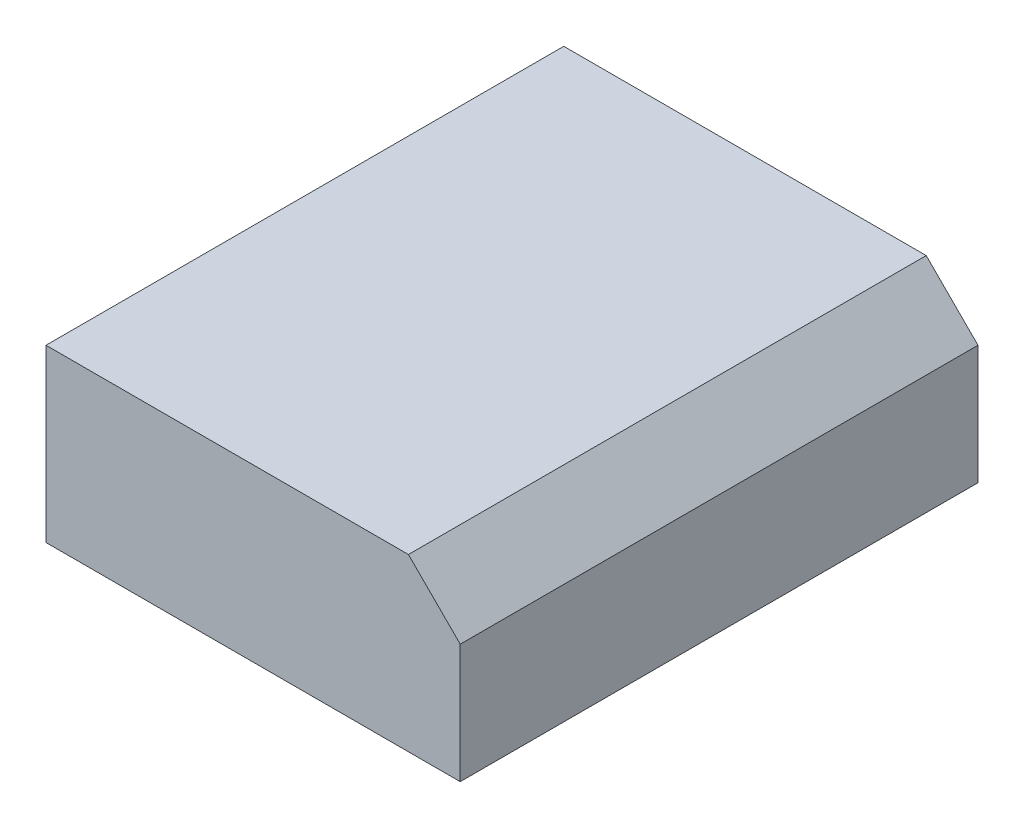
ISO-10303-21;
HEADER;
FILE_DESCRIPTION(('STEP AP214'),'2;1');
FILE_NAME('part.step','',(''),(''),'','','');
FILE_SCHEMA(('AUTOMOTIVE_DESIGN { 1 0 10303 214 1 1 1 1 }'));
ENDSEC;
DATA;
#1=APPLICATION_CONTEXT('core data for automotive mechanical design processes');
#2=APPLICATION_PROTOCOL_DEFINITION('international standard','automotive_design',2000,#1);
#3=PRODUCT_CONTEXT('',#1,'mechanical');
#4=PRODUCT('Part','Part','',(#3));
#5=PRODUCT_RELATED_PRODUCT_CATEGORY('part','',(#4));
#6=PRODUCT_DEFINITION_FORMATION('','',#4);
#7=PRODUCT_DEFINITION_CONTEXT('part definition',#1,'design');
#8=PRODUCT_DEFINITION('design','',#6,#7);
#9=PRODUCT_DEFINITION_SHAPE('','',#8);
#10=(LENGTH_UNIT() NAMED_UNIT(*) SI_UNIT(.MILLI.,.METRE.));
#11=(NAMED_UNIT(*) PLANE_ANGLE_UNIT() SI_UNIT($,.RADIAN.));
#12=(NAMED_UNIT(*) SI_UNIT($,.STERADIAN.) SOLID_ANGLE_UNIT());
#13=UNCERTAINTY_MEASURE_WITH_UNIT(LENGTH_MEASURE(1.E-05),#10,'distance_accuracy_value','');
#14=(GEOMETRIC_REPRESENTATION_CONTEXT(3) GLOBAL_UNCERTAINTY_ASSIGNED_CONTEXT((#13)) GLOBAL_UNIT_ASSIGNED_CONTEXT((#10,
#11,#12)) REPRESENTATION_CONTEXT('',''));
#15=CARTESIAN_POINT('',(0.,0.,0.));
#16=DIRECTION('',(0.,0.,1.));
#17=DIRECTION('',(1.,0.,0.));
#18=AXIS2_PLACEMENT_3D('',#15,#16,#17);
#19=CARTESIAN_POINT('',(1.205,0.1,1.55));
#20=DIRECTION('',(-1.,0.,0.));
#21=DIRECTION('',(0.,0.,1.));
#22=AXIS2_PLACEMENT_3D('',#19,#20,#21);
#23=PLANE('',#22);
#24=DIRECTION('',(0.,0.,-1.));
#25=VECTOR('',#24,1.);
#26=CARTESIAN_POINT('',(1.205,0.,1.55));
#27=LINE('',#26,#25);
#28=CARTESIAN_POINT('',(1.205,0.,1.55));
#29=VERTEX_POINT('',#28);
#30=CARTESIAN_POINT('',(1.205,0.,-1.55));
#31=VERTEX_POINT('',#30);
#32=EDGE_CURVE('E103',#29,#31,#27,.T.);
#33=ORIENTED_EDGE('',*,*,#32,.T.);
#34=DIRECTION('',(0.,-1.,0.));
#35=VECTOR('',#34,1.);
#36=CARTESIAN_POINT('',(1.205,0.1,-1.55));
#37=LINE('',#36,#35);
#38=CARTESIAN_POINT('',(1.205,0.1,-1.55));
#39=VERTEX_POINT('',#38);
#40=EDGE_CURVE('E12',#39,#31,#37,.T.);
#41=ORIENTED_EDGE('',*,*,#40,.F.);
#42=DIRECTION('',(0.,0.,-1.));
#43=VECTOR('',#42,1.);
#44=CARTESIAN_POINT('',(1.205,0.1,1.55));
#45=LINE('',#44,#43);
#46=CARTESIAN_POINT('',(1.205,0.1,1.55));
#47=VERTEX_POINT('',#46);
#48=EDGE_CURVE('E91',#47,#39,#45,.T.);
#49=ORIENTED_EDGE('',*,*,#48,.F.);
#50=DIRECTION('',(0.,-1.,0.));
#51=VECTOR('',#50,1.);
#52=CARTESIAN_POINT('',(1.205,0.1,1.55));
#53=LINE('',#52,#51);
#54=EDGE_CURVE('E99',#47,#29,#53,.T.);
#55=ORIENTED_EDGE('',*,*,#54,.T.);
#56=EDGE_LOOP('',(#33,#41,#49,#55));
#57=FACE_BOUND('',#56,.T.);
#58=ADVANCED_FACE('F40',(#57),#23,.F.);
#59=CARTESIAN_POINT('',(-1.205,0.1,-1.55));
#60=DIRECTION('',(0.,0.,1.));
#61=DIRECTION('',(1.,0.,0.));
#62=AXIS2_PLACEMENT_3D('',#59,#60,#61);
#63=PLANE('',#62);
#64=DIRECTION('',(-1.,0.,0.));
#65=VECTOR('',#64,1.);
#66=CARTESIAN_POINT('',(-1.205,0.,-1.55));
#67=LINE('',#66,#65);
#68=CARTESIAN_POINT('',(-1.205,0.,-1.55));
#69=VERTEX_POINT('',#68);
#70=EDGE_CURVE('E95',#31,#69,#67,.T.);
#71=ORIENTED_EDGE('',*,*,#70,.T.);
#72=DIRECTION('',(0.,-1.,0.));
#73=VECTOR('',#72,1.);
#74=CARTESIAN_POINT('',(-1.205,0.1,-1.55));
#75=LINE('',#74,#73);
#76=CARTESIAN_POINT('',(-1.205,0.1,-1.55));
#77=VERTEX_POINT('',#76);
#78=EDGE_CURVE('E48',#77,#69,#75,.T.);
#79=ORIENTED_EDGE('',*,*,#78,.F.);
#80=DIRECTION('',(-1.,0.,0.));
#81=VECTOR('',#80,1.);
#82=CARTESIAN_POINT('',(-1.205,0.1,-1.55));
#83=LINE('',#82,#81);
#84=EDGE_CURVE('E86',#39,#77,#83,.T.);
#85=ORIENTED_EDGE('',*,*,#84,.F.);
#86=ORIENTED_EDGE('',*,*,#40,.T.);
#87=EDGE_LOOP('',(#71,#79,#85,#86));
#88=FACE_BOUND('',#87,.T.);
#89=ADVANCED_FACE('F94',(#88),#63,.F.);
#90=CARTESIAN_POINT('',(-1.205,0.1,1.55));
#91=DIRECTION('',(1.,0.,0.));
#92=DIRECTION('',(0.,0.,-1.));
#93=AXIS2_PLACEMENT_3D('',#90,#91,#92);
#94=PLANE('',#93);
#95=DIRECTION('',(0.,0.,1.));
#96=VECTOR('',#95,1.);
#97=CARTESIAN_POINT('',(-1.205,0.,1.55));
#98=LINE('',#97,#96);
#99=CARTESIAN_POINT('',(-1.205,0.,1.55));
#100=VERTEX_POINT('',#99);
#101=EDGE_CURVE('E73',#69,#100,#98,.T.);
#102=ORIENTED_EDGE('',*,*,#101,.T.);
#103=DIRECTION('',(0.,-1.,0.));
#104=VECTOR('',#103,1.);
#105=CARTESIAN_POINT('',(-1.205,0.1,1.55));
#106=LINE('',#105,#104);
#107=CARTESIAN_POINT('',(-1.205,0.1,1.55));
#108=VERTEX_POINT('',#107);
#109=EDGE_CURVE('E96',#108,#100,#106,.T.);
#110=ORIENTED_EDGE('',*,*,#109,.F.);
#111=DIRECTION('',(0.,0.,1.));
#112=VECTOR('',#111,1.);
#113=CARTESIAN_POINT('',(-1.205,0.1,1.55));
#114=LINE('',#113,#112);
#115=EDGE_CURVE('E89',#77,#108,#114,.T.);
#116=ORIENTED_EDGE('',*,*,#115,.F.);
#117=ORIENTED_EDGE('',*,*,#78,.T.);
#118=EDGE_LOOP('',(#102,#110,#116,#117));
#119=FACE_BOUND('',#118,.T.);
#120=ADVANCED_FACE('F97',(#119),#94,.F.);
#121=CARTESIAN_POINT('',(-1.205,0.1,1.55));
#122=DIRECTION('',(0.,0.,-1.));
#123=DIRECTION('',(-1.,0.,0.));
#124=AXIS2_PLACEMENT_3D('',#121,#122,#123);
#125=PLANE('',#124);
#126=DIRECTION('',(1.,0.,0.));
#127=VECTOR('',#126,1.);
#128=CARTESIAN_POINT('',(-1.205,0.,1.55));
#129=LINE('',#128,#127);
#130=EDGE_CURVE('E79',#100,#29,#129,.T.);
#131=ORIENTED_EDGE('',*,*,#130,.T.);
#132=ORIENTED_EDGE('',*,*,#54,.F.);
#133=DIRECTION('',(1.,0.,0.));
#134=VECTOR('',#133,1.);
#135=CARTESIAN_POINT('',(-1.205,0.1,1.55));
#136=LINE('',#135,#134);
#137=EDGE_CURVE('E56',#108,#47,#136,.T.);
#138=ORIENTED_EDGE('',*,*,#137,.F.);
#139=ORIENTED_EDGE('',*,*,#109,.T.);
#140=EDGE_LOOP('',(#131,#132,#138,#139));
#141=FACE_BOUND('',#140,.T.);
#142=ADVANCED_FACE('F110',(#141),#125,.F.);
#143=CARTESIAN_POINT('',(1.205,0.1,-1.55));
#144=DIRECTION('',(0.,-1.,0.));
#145=DIRECTION('',(0.,0.,-1.));
#146=AXIS2_PLACEMENT_3D('',#143,#144,#145);
#147=PLANE('',#146);
#148=ORIENTED_EDGE('',*,*,#48,.T.);
#149=ORIENTED_EDGE('',*,*,#84,.T.);
#150=ORIENTED_EDGE('',*,*,#115,.T.);
#151=ORIENTED_EDGE('',*,*,#137,.T.);
#152=EDGE_LOOP('',(#148,#149,#150,#151));
#153=FACE_BOUND('',#152,.T.);
#154=ADVANCED_FACE('F87',(#153),#147,.F.);
#155=CARTESIAN_POINT('',(1.205,0.,-1.55));
#156=DIRECTION('',(0.,-1.,0.));
#157=DIRECTION('',(0.,0.,-1.));
#158=AXIS2_PLACEMENT_3D('',#155,#156,#157);
#159=PLANE('',#158);
#160=ORIENTED_EDGE('',*,*,#32,.F.);
#161=ORIENTED_EDGE('',*,*,#130,.F.);
#162=ORIENTED_EDGE('',*,*,#101,.F.);
#163=ORIENTED_EDGE('',*,*,#70,.F.);
#164=EDGE_LOOP('',(#160,#161,#162,#163));
#165=FACE_BOUND('',#164,.T.);
#166=ADVANCED_FACE('F113',(#165),#159,.T.);
#167=CLOSED_SHELL('',(#58,#89,#120,#142,#154,#166));
#168=MANIFOLD_SOLID_BREP('B2',#167);
#169=CARTESIAN_POINT('',(2.,1.75,2.5));
#170=DIRECTION('',(-1.,0.,0.));
#171=DIRECTION('',(0.,0.,1.));
#172=AXIS2_PLACEMENT_3D('',#169,#170,#171);
#173=PLANE('',#172);
#174=DIRECTION('',(0.,-1.,0.));
#175=VECTOR('',#174,1.);
#176=CARTESIAN_POINT('',(2.,1.75,-2.5));
#177=LINE('',#176,#175);
#178=CARTESIAN_POINT('',(2.,1.25,-2.5));
#179=VERTEX_POINT('',#178);
#180=CARTESIAN_POINT('',(2.,0.1,-2.5));
#181=VERTEX_POINT('',#180);
#182=EDGE_CURVE('E225',#179,#181,#177,.T.);
#183=ORIENTED_EDGE('',*,*,#182,.F.);
#184=DIRECTION('',(0.,0.,1.));
#185=VECTOR('',#184,1.);
#186=CARTESIAN_POINT('',(2.,1.25,2.5));
#187=LINE('',#186,#185);
#188=CARTESIAN_POINT('',(2.,1.25,2.5));
#189=VERTEX_POINT('',#188);
#190=EDGE_CURVE('E171',#179,#189,#187,.T.);
#191=ORIENTED_EDGE('',*,*,#190,.T.);
#192=DIRECTION('',(0.,-1.,0.));
#193=VECTOR('',#192,1.);
#194=CARTESIAN_POINT('',(2.,1.75,2.5));
#195=LINE('',#194,#193);
#196=CARTESIAN_POINT('',(2.,0.1,2.5));
#197=VERTEX_POINT('',#196);
#198=EDGE_CURVE('E233',#189,#197,#195,.T.);
#199=ORIENTED_EDGE('',*,*,#198,.T.);
#200=DIRECTION('',(0.,0.,-1.));
#201=VECTOR('',#200,1.);
#202=CARTESIAN_POINT('',(2.,0.1,2.5));
#203=LINE('',#202,#201);
#204=EDGE_CURVE('E236',#197,#181,#203,.T.);
#205=ORIENTED_EDGE('',*,*,#204,.T.);
#206=EDGE_LOOP('',(#183,#191,#199,#205));
#207=FACE_BOUND('',#206,.T.);
#208=ADVANCED_FACE('F163',(#207),#173,.F.);
#209=CARTESIAN_POINT('',(-2.,1.75,-2.5));
#210=DIRECTION('',(0.,0.,1.));
#211=DIRECTION('',(1.,0.,0.));
#212=AXIS2_PLACEMENT_3D('',#209,#210,#211);
#213=PLANE('',#212);
#214=DIRECTION('',(-1.,0.,0.));
#215=VECTOR('',#214,1.);
#216=CARTESIAN_POINT('',(-2.,1.75,-2.5));
#217=LINE('',#216,#215);
#218=CARTESIAN_POINT('',(1.5,1.75,-2.5));
#219=VERTEX_POINT('',#218);
#220=CARTESIAN_POINT('',(-2.,1.75,-2.5));
#221=VERTEX_POINT('',#220);
#222=EDGE_CURVE('E207',#219,#221,#217,.T.);
#223=ORIENTED_EDGE('',*,*,#222,.F.);
#224=DIRECTION('',(-0.707106781186546,0.707106781186549,0.));
#225=VECTOR('',#224,1.);
#226=CARTESIAN_POINT('',(1.5,1.75,-2.5));
#227=LINE('',#226,#225);
#228=EDGE_CURVE('E185',#219,#179,#227,.F.);
#229=ORIENTED_EDGE('',*,*,#228,.T.);
#230=ORIENTED_EDGE('',*,*,#182,.T.);
#231=DIRECTION('',(-1.,0.,0.));
#232=VECTOR('',#231,1.);
#233=CARTESIAN_POINT('',(-2.,0.1,-2.5));
#234=LINE('',#233,#232);
#235=CARTESIAN_POINT('',(-2.,0.1,-2.5));
#236=VERTEX_POINT('',#235);
#237=EDGE_CURVE('E222',#181,#236,#234,.T.);
#238=ORIENTED_EDGE('',*,*,#237,.T.);
#239=DIRECTION('',(0.,-1.,0.));
#240=VECTOR('',#239,1.);
#241=CARTESIAN_POINT('',(-2.,1.75,-2.5));
#242=LINE('',#241,#240);
#243=EDGE_CURVE('E219',#221,#236,#242,.T.);
#244=ORIENTED_EDGE('',*,*,#243,.F.);
#245=EDGE_LOOP('',(#223,#229,#230,#238,#244));
#246=FACE_BOUND('',#245,.T.);
#247=ADVANCED_FACE('F220',(#246),#213,.F.);
#248=CARTESIAN_POINT('',(-2.,1.75,2.5));
#249=DIRECTION('',(1.,0.,0.));
#250=DIRECTION('',(0.,0.,-1.));
#251=AXIS2_PLACEMENT_3D('',#248,#249,#250);
#252=PLANE('',#251);
#253=DIRECTION('',(0.,0.,1.));
#254=VECTOR('',#253,1.);
#255=CARTESIAN_POINT('',(-2.,0.1,2.5));
#256=LINE('',#255,#254);
#257=CARTESIAN_POINT('',(-2.,0.1,2.5));
#258=VERTEX_POINT('',#257);
#259=EDGE_CURVE('E240',#236,#258,#256,.T.);
#260=ORIENTED_EDGE('',*,*,#259,.T.);
#261=DIRECTION('',(0.,-1.,0.));
#262=VECTOR('',#261,1.);
#263=CARTESIAN_POINT('',(-2.,1.75,2.5));
#264=LINE('',#263,#262);
#265=CARTESIAN_POINT('',(-2.,1.75,2.5));
#266=VERTEX_POINT('',#265);
#267=EDGE_CURVE('E226',#266,#258,#264,.T.);
#268=ORIENTED_EDGE('',*,*,#267,.F.);
#269=DIRECTION('',(0.,0.,1.));
#270=VECTOR('',#269,1.);
#271=CARTESIAN_POINT('',(-2.,1.75,2.5));
#272=LINE('',#271,#270);
#273=EDGE_CURVE('E212',#221,#266,#272,.T.);
#274=ORIENTED_EDGE('',*,*,#273,.F.);
#275=ORIENTED_EDGE('',*,*,#243,.T.);
#276=EDGE_LOOP('',(#260,#268,#274,#275));
#277=FACE_BOUND('',#276,.T.);
#278=ADVANCED_FACE('F228',(#277),#252,.F.);
#279=CARTESIAN_POINT('',(-2.,1.75,2.5));
#280=DIRECTION('',(0.,0.,-1.));
#281=DIRECTION('',(-1.,0.,0.));
#282=AXIS2_PLACEMENT_3D('',#279,#280,#281);
#283=PLANE('',#282);
#284=ORIENTED_EDGE('',*,*,#198,.F.);
#285=DIRECTION('',(0.707106781186546,-0.707106781186549,0.));
#286=VECTOR('',#285,1.);
#287=CARTESIAN_POINT('',(1.5,1.75,2.5));
#288=LINE('',#287,#286);
#289=CARTESIAN_POINT('',(1.5,1.75,2.5));
#290=VERTEX_POINT('',#289);
#291=EDGE_CURVE('E38',#189,#290,#288,.F.);
#292=ORIENTED_EDGE('',*,*,#291,.T.);
#293=DIRECTION('',(1.,0.,0.));
#294=VECTOR('',#293,1.);
#295=CARTESIAN_POINT('',(-2.,1.75,2.5));
#296=LINE('',#295,#294);
#297=EDGE_CURVE('E231',#266,#290,#296,.T.);
#298=ORIENTED_EDGE('',*,*,#297,.F.);
#299=ORIENTED_EDGE('',*,*,#267,.T.);
#300=DIRECTION('',(1.,0.,0.));
#301=VECTOR('',#300,1.);
#302=CARTESIAN_POINT('',(-2.,0.1,2.5));
#303=LINE('',#302,#301);
#304=EDGE_CURVE('E216',#258,#197,#303,.T.);
#305=ORIENTED_EDGE('',*,*,#304,.T.);
#306=EDGE_LOOP('',(#284,#292,#298,#299,#305));
#307=FACE_BOUND('',#306,.T.);
#308=ADVANCED_FACE('F254',(#307),#283,.F.);
#309=CARTESIAN_POINT('',(2.,1.75,-2.5));
#310=DIRECTION('',(0.,-1.,0.));
#311=DIRECTION('',(0.,0.,-1.));
#312=AXIS2_PLACEMENT_3D('',#309,#310,#311);
#313=PLANE('',#312);
#314=ORIENTED_EDGE('',*,*,#297,.T.);
#315=DIRECTION('',(0.,0.,-1.));
#316=VECTOR('',#315,1.);
#317=CARTESIAN_POINT('',(1.5,1.75,-2.5));
#318=LINE('',#317,#316);
#319=EDGE_CURVE('E215',#290,#219,#318,.T.);
#320=ORIENTED_EDGE('',*,*,#319,.T.);
#321=ORIENTED_EDGE('',*,*,#222,.T.);
#322=ORIENTED_EDGE('',*,*,#273,.T.);
#323=EDGE_LOOP('',(#314,#320,#321,#322));
#324=FACE_BOUND('',#323,.T.);
#325=ADVANCED_FACE('F210',(#324),#313,.F.);
#326=CARTESIAN_POINT('',(2.,0.1,-2.5));
#327=DIRECTION('',(0.,-1.,0.));
#328=DIRECTION('',(0.,0.,-1.));
#329=AXIS2_PLACEMENT_3D('',#326,#327,#328);
#330=PLANE('',#329);
#331=ORIENTED_EDGE('',*,*,#204,.F.);
#332=ORIENTED_EDGE('',*,*,#304,.F.);
#333=ORIENTED_EDGE('',*,*,#259,.F.);
#334=ORIENTED_EDGE('',*,*,#237,.F.);
#335=EDGE_LOOP('',(#331,#332,#333,#334));
#336=FACE_BOUND('',#335,.T.);
#337=ADVANCED_FACE('F250',(#336),#330,.T.);
#338=CARTESIAN_POINT('',(1.5,1.75,-2.5));
#339=DIRECTION('',(-0.707106781186549,-0.707106781186546,0.));
#340=DIRECTION('',(0.707106781186546,-0.707106781186549,0.));
#341=AXIS2_PLACEMENT_3D('',#338,#339,#340);
#342=PLANE('',#341);
#343=ORIENTED_EDGE('',*,*,#291,.F.);
#344=ORIENTED_EDGE('',*,*,#190,.F.);
#345=ORIENTED_EDGE('',*,*,#228,.F.);
#346=ORIENTED_EDGE('',*,*,#319,.F.);
#347=EDGE_LOOP('',(#343,#344,#345,#346));
#348=FACE_BOUND('',#347,.T.);
#349=ADVANCED_FACE('F165',(#348),#342,.F.);
#350=CLOSED_SHELL('',(#208,#247,#278,#308,#325,#337,#349));
#351=MANIFOLD_SOLID_BREP('B6',#350);
#352=ADVANCED_BREP_SHAPE_REPRESENTATION('',(#18,#168,#351),#14);
#353=SHAPE_DEFINITION_REPRESENTATION(#9,#352);
ENDSEC;
END-ISO-10303-21;
